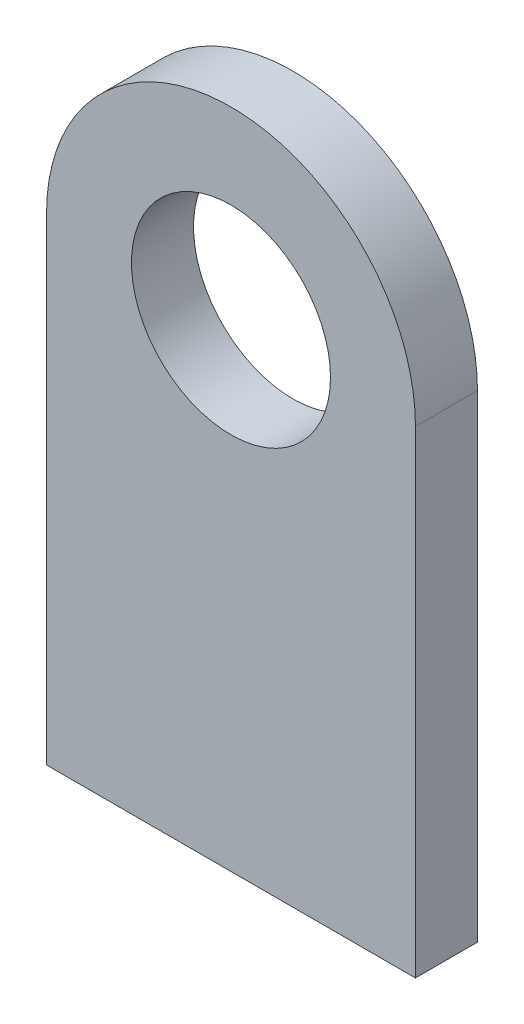
ISO-10303-21;
HEADER;
FILE_DESCRIPTION(('STEP AP214'),'2;1');
FILE_NAME('part.step','',(''),(''),'','','');
FILE_SCHEMA(('AUTOMOTIVE_DESIGN { 1 0 10303 214 1 1 1 1 }'));
ENDSEC;
DATA;
#1=APPLICATION_CONTEXT('core data for automotive mechanical design processes');
#2=APPLICATION_PROTOCOL_DEFINITION('international standard','automotive_design',2000,#1);
#3=PRODUCT_CONTEXT('',#1,'mechanical');
#4=PRODUCT('Part','Part','',(#3));
#5=PRODUCT_RELATED_PRODUCT_CATEGORY('part','',(#4));
#6=PRODUCT_DEFINITION_FORMATION('','',#4);
#7=PRODUCT_DEFINITION_CONTEXT('part definition',#1,'design');
#8=PRODUCT_DEFINITION('design','',#6,#7);
#9=PRODUCT_DEFINITION_SHAPE('','',#8);
#10=(LENGTH_UNIT() NAMED_UNIT(*) SI_UNIT(.MILLI.,.METRE.));
#11=(NAMED_UNIT(*) PLANE_ANGLE_UNIT() SI_UNIT($,.RADIAN.));
#12=(NAMED_UNIT(*) SI_UNIT($,.STERADIAN.) SOLID_ANGLE_UNIT());
#13=UNCERTAINTY_MEASURE_WITH_UNIT(LENGTH_MEASURE(1.E-05),#10,'distance_accuracy_value','');
#14=(GEOMETRIC_REPRESENTATION_CONTEXT(3) GLOBAL_UNCERTAINTY_ASSIGNED_CONTEXT((#13)) GLOBAL_UNIT_ASSIGNED_CONTEXT((#10,
#11,#12)) REPRESENTATION_CONTEXT('',''));
#15=CARTESIAN_POINT('',(0.,0.,0.));
#16=DIRECTION('',(0.,0.,1.));
#17=DIRECTION('',(1.,0.,0.));
#18=AXIS2_PLACEMENT_3D('',#15,#16,#17);
#19=CARTESIAN_POINT('',(0.,0.,9.35));
#20=DIRECTION('',(0.,0.,1.));
#21=DIRECTION('',(1.,0.,0.));
#22=AXIS2_PLACEMENT_3D('',#19,#20,#21);
#23=PLANE('',#22);
#24=CARTESIAN_POINT('',(0.,0.,9.35));
#25=DIRECTION('',(0.,0.,1.));
#26=DIRECTION('',(1.,0.,0.));
#27=AXIS2_PLACEMENT_3D('',#24,#25,#26);
#28=CIRCLE('',#27,27.8);
#29=CARTESIAN_POINT('',(27.8,0.,9.35));
#30=VERTEX_POINT('',#29);
#31=CARTESIAN_POINT('',(-27.8,0.,9.35));
#32=VERTEX_POINT('',#31);
#33=EDGE_CURVE('E98',#30,#32,#28,.T.);
#34=ORIENTED_EDGE('',*,*,#33,.T.);
#35=DIRECTION('',(0.,-1.,0.));
#36=VECTOR('',#35,1.);
#37=CARTESIAN_POINT('',(-27.8,0.,9.35));
#38=LINE('',#37,#36);
#39=CARTESIAN_POINT('',(-27.8,-72.,9.35));
#40=VERTEX_POINT('',#39);
#41=EDGE_CURVE('E93',#32,#40,#38,.T.);
#42=ORIENTED_EDGE('',*,*,#41,.T.);
#43=DIRECTION('',(1.,0.,0.));
#44=VECTOR('',#43,1.);
#45=CARTESIAN_POINT('',(-27.8,-72.,9.35));
#46=LINE('',#45,#44);
#47=CARTESIAN_POINT('',(27.8,-72.,9.35));
#48=VERTEX_POINT('',#47);
#49=EDGE_CURVE('E96',#40,#48,#46,.T.);
#50=ORIENTED_EDGE('',*,*,#49,.T.);
#51=DIRECTION('',(0.,1.,0.));
#52=VECTOR('',#51,1.);
#53=CARTESIAN_POINT('',(27.8,0.,9.35));
#54=LINE('',#53,#52);
#55=EDGE_CURVE('E63',#48,#30,#54,.T.);
#56=ORIENTED_EDGE('',*,*,#55,.T.);
#57=EDGE_LOOP('',(#34,#42,#50,#56));
#58=FACE_BOUND('',#57,.T.);
#59=CARTESIAN_POINT('',(0.,0.,9.35));
#60=DIRECTION('',(0.,0.,1.));
#61=DIRECTION('',(1.,0.,0.));
#62=AXIS2_PLACEMENT_3D('',#59,#60,#61);
#63=CIRCLE('',#62,15.);
#64=CARTESIAN_POINT('',(15.,0.,9.35));
#65=VERTEX_POINT('',#64);
#66=EDGE_CURVE('E118',#65,#65,#63,.T.);
#67=ORIENTED_EDGE('',*,*,#66,.F.);
#68=EDGE_LOOP('',(#67));
#69=FACE_BOUND('',#68,.T.);
#70=ADVANCED_FACE('F45',(#58,#69),#23,.T.);
#71=CARTESIAN_POINT('',(0.,0.,0.));
#72=DIRECTION('',(0.,0.,1.));
#73=DIRECTION('',(1.,0.,0.));
#74=AXIS2_PLACEMENT_3D('',#71,#72,#73);
#75=PLANE('',#74);
#76=CARTESIAN_POINT('',(0.,0.,0.));
#77=DIRECTION('',(0.,0.,1.));
#78=DIRECTION('',(1.,0.,0.));
#79=AXIS2_PLACEMENT_3D('',#76,#77,#78);
#80=CIRCLE('',#79,27.8);
#81=CARTESIAN_POINT('',(27.8,0.,0.));
#82=VERTEX_POINT('',#81);
#83=CARTESIAN_POINT('',(-27.8,0.,0.));
#84=VERTEX_POINT('',#83);
#85=EDGE_CURVE('E114',#82,#84,#80,.T.);
#86=ORIENTED_EDGE('',*,*,#85,.F.);
#87=DIRECTION('',(0.,1.,0.));
#88=VECTOR('',#87,1.);
#89=CARTESIAN_POINT('',(27.8,0.,0.));
#90=LINE('',#89,#88);
#91=CARTESIAN_POINT('',(27.8,-72.,0.));
#92=VERTEX_POINT('',#91);
#93=EDGE_CURVE('E86',#92,#82,#90,.T.);
#94=ORIENTED_EDGE('',*,*,#93,.F.);
#95=DIRECTION('',(1.,0.,0.));
#96=VECTOR('',#95,1.);
#97=CARTESIAN_POINT('',(-27.8,-72.,0.));
#98=LINE('',#97,#96);
#99=CARTESIAN_POINT('',(-27.8,-72.,0.));
#100=VERTEX_POINT('',#99);
#101=EDGE_CURVE('E80',#100,#92,#98,.T.);
#102=ORIENTED_EDGE('',*,*,#101,.F.);
#103=DIRECTION('',(0.,-1.,0.));
#104=VECTOR('',#103,1.);
#105=CARTESIAN_POINT('',(-27.8,0.,0.));
#106=LINE('',#105,#104);
#107=EDGE_CURVE('E103',#84,#100,#106,.T.);
#108=ORIENTED_EDGE('',*,*,#107,.F.);
#109=EDGE_LOOP('',(#86,#94,#102,#108));
#110=FACE_BOUND('',#109,.T.);
#111=CARTESIAN_POINT('',(0.,0.,0.));
#112=DIRECTION('',(0.,0.,1.));
#113=DIRECTION('',(1.,0.,0.));
#114=AXIS2_PLACEMENT_3D('',#111,#112,#113);
#115=CIRCLE('',#114,15.);
#116=CARTESIAN_POINT('',(15.,0.,0.));
#117=VERTEX_POINT('',#116);
#118=EDGE_CURVE('E136',#117,#117,#115,.T.);
#119=ORIENTED_EDGE('',*,*,#118,.T.);
#120=EDGE_LOOP('',(#119));
#121=FACE_BOUND('',#120,.T.);
#122=ADVANCED_FACE('F131',(#110,#121),#75,.F.);
#123=CARTESIAN_POINT('',(0.,0.,9.35));
#124=DIRECTION('',(0.,0.,-1.));
#125=DIRECTION('',(-1.,0.,0.));
#126=AXIS2_PLACEMENT_3D('',#123,#124,#125);
#127=CYLINDRICAL_SURFACE('',#126,27.8);
#128=ORIENTED_EDGE('',*,*,#85,.T.);
#129=DIRECTION('',(0.,0.,-1.));
#130=VECTOR('',#129,1.);
#131=CARTESIAN_POINT('',(-27.8,0.,9.35));
#132=LINE('',#131,#130);
#133=EDGE_CURVE('E11',#32,#84,#132,.T.);
#134=ORIENTED_EDGE('',*,*,#133,.F.);
#135=ORIENTED_EDGE('',*,*,#33,.F.);
#136=DIRECTION('',(0.,0.,-1.));
#137=VECTOR('',#136,1.);
#138=CARTESIAN_POINT('',(27.8,0.,9.35));
#139=LINE('',#138,#137);
#140=EDGE_CURVE('E110',#30,#82,#139,.T.);
#141=ORIENTED_EDGE('',*,*,#140,.T.);
#142=EDGE_LOOP('',(#128,#134,#135,#141));
#143=FACE_BOUND('',#142,.T.);
#144=ADVANCED_FACE('F47',(#143),#127,.T.);
#145=CARTESIAN_POINT('',(-27.8,0.,9.35));
#146=DIRECTION('',(1.,0.,0.));
#147=DIRECTION('',(0.,1.,0.));
#148=AXIS2_PLACEMENT_3D('',#145,#146,#147);
#149=PLANE('',#148);
#150=ORIENTED_EDGE('',*,*,#107,.T.);
#151=DIRECTION('',(0.,0.,-1.));
#152=VECTOR('',#151,1.);
#153=CARTESIAN_POINT('',(-27.8,-72.,9.35));
#154=LINE('',#153,#152);
#155=EDGE_CURVE('E55',#40,#100,#154,.T.);
#156=ORIENTED_EDGE('',*,*,#155,.F.);
#157=ORIENTED_EDGE('',*,*,#41,.F.);
#158=ORIENTED_EDGE('',*,*,#133,.T.);
#159=EDGE_LOOP('',(#150,#156,#157,#158));
#160=FACE_BOUND('',#159,.T.);
#161=ADVANCED_FACE('F102',(#160),#149,.F.);
#162=CARTESIAN_POINT('',(-27.8,-72.,9.35));
#163=DIRECTION('',(0.,1.,0.));
#164=DIRECTION('',(0.,0.,1.));
#165=AXIS2_PLACEMENT_3D('',#162,#163,#164);
#166=PLANE('',#165);
#167=ORIENTED_EDGE('',*,*,#101,.T.);
#168=DIRECTION('',(0.,0.,-1.));
#169=VECTOR('',#168,1.);
#170=CARTESIAN_POINT('',(27.8,-72.,9.35));
#171=LINE('',#170,#169);
#172=EDGE_CURVE('E105',#48,#92,#171,.T.);
#173=ORIENTED_EDGE('',*,*,#172,.F.);
#174=ORIENTED_EDGE('',*,*,#49,.F.);
#175=ORIENTED_EDGE('',*,*,#155,.T.);
#176=EDGE_LOOP('',(#167,#173,#174,#175));
#177=FACE_BOUND('',#176,.T.);
#178=ADVANCED_FACE('F106',(#177),#166,.F.);
#179=CARTESIAN_POINT('',(27.8,0.,9.35));
#180=DIRECTION('',(-1.,0.,0.));
#181=DIRECTION('',(0.,0.,1.));
#182=AXIS2_PLACEMENT_3D('',#179,#180,#181);
#183=PLANE('',#182);
#184=ORIENTED_EDGE('',*,*,#93,.T.);
#185=ORIENTED_EDGE('',*,*,#140,.F.);
#186=ORIENTED_EDGE('',*,*,#55,.F.);
#187=ORIENTED_EDGE('',*,*,#172,.T.);
#188=EDGE_LOOP('',(#184,#185,#186,#187));
#189=FACE_BOUND('',#188,.T.);
#190=ADVANCED_FACE('F128',(#189),#183,.F.);
#191=CARTESIAN_POINT('',(0.,0.,9.35));
#192=DIRECTION('',(0.,0.,-1.));
#193=DIRECTION('',(-1.,0.,0.));
#194=AXIS2_PLACEMENT_3D('',#191,#192,#193);
#195=CYLINDRICAL_SURFACE('',#194,15.);
#196=ORIENTED_EDGE('',*,*,#66,.T.);
#197=EDGE_LOOP('',(#196));
#198=FACE_BOUND('',#197,.T.);
#199=ORIENTED_EDGE('',*,*,#118,.F.);
#200=EDGE_LOOP('',(#199));
#201=FACE_BOUND('',#200,.T.);
#202=ADVANCED_FACE('F144',(#198,#201),#195,.F.);
#203=CLOSED_SHELL('',(#70,#122,#144,#161,#178,#190,#202));
#204=MANIFOLD_SOLID_BREP('B2',#203);
#205=ADVANCED_BREP_SHAPE_REPRESENTATION('',(#18,#204),#14);
#206=SHAPE_DEFINITION_REPRESENTATION(#9,#205);
ENDSEC;
END-ISO-10303-21;
